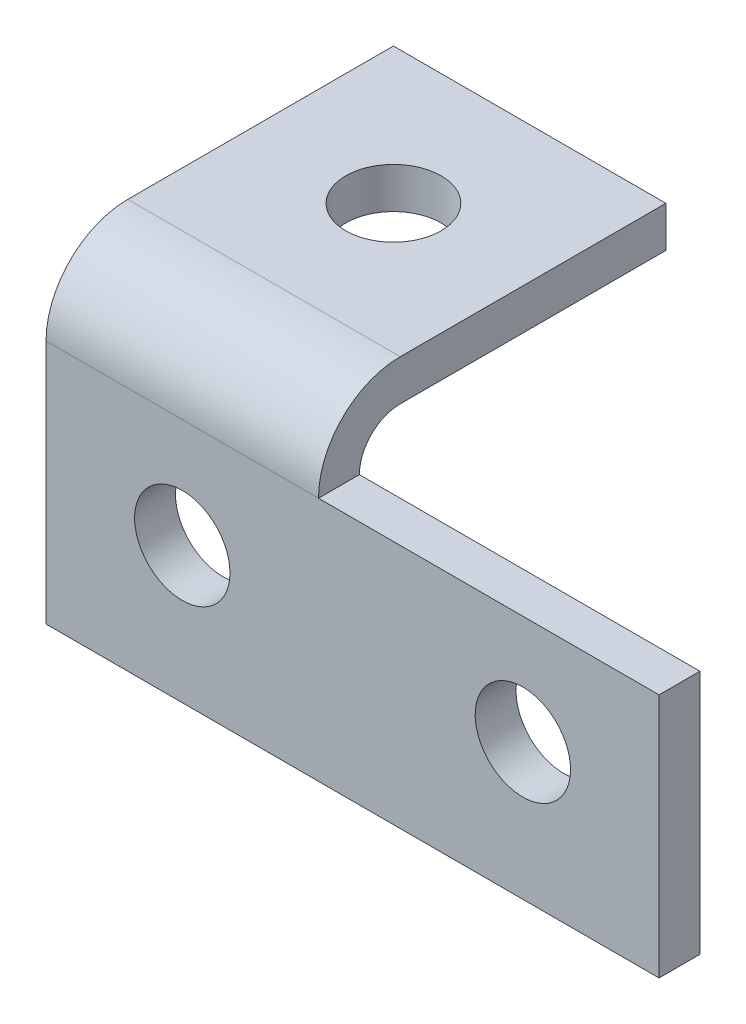
ISO-10303-21;
HEADER;
FILE_DESCRIPTION(('STEP AP214'),'2;1');
FILE_NAME('part.step','',(''),(''),'','','');
FILE_SCHEMA(('AUTOMOTIVE_DESIGN { 1 0 10303 214 1 1 1 1 }'));
ENDSEC;
DATA;
#1=APPLICATION_CONTEXT('core data for automotive mechanical design processes');
#2=APPLICATION_PROTOCOL_DEFINITION('international standard','automotive_design',2000,#1);
#3=PRODUCT_CONTEXT('',#1,'mechanical');
#4=PRODUCT('Part','Part','',(#3));
#5=PRODUCT_RELATED_PRODUCT_CATEGORY('part','',(#4));
#6=PRODUCT_DEFINITION_FORMATION('','',#4);
#7=PRODUCT_DEFINITION_CONTEXT('part definition',#1,'design');
#8=PRODUCT_DEFINITION('design','',#6,#7);
#9=PRODUCT_DEFINITION_SHAPE('','',#8);
#10=(LENGTH_UNIT() NAMED_UNIT(*) SI_UNIT(.MILLI.,.METRE.));
#11=(NAMED_UNIT(*) PLANE_ANGLE_UNIT() SI_UNIT($,.RADIAN.));
#12=(NAMED_UNIT(*) SI_UNIT($,.STERADIAN.) SOLID_ANGLE_UNIT());
#13=UNCERTAINTY_MEASURE_WITH_UNIT(LENGTH_MEASURE(1.E-05),#10,'distance_accuracy_value','');
#14=(GEOMETRIC_REPRESENTATION_CONTEXT(3) GLOBAL_UNCERTAINTY_ASSIGNED_CONTEXT((#13)) GLOBAL_UNIT_ASSIGNED_CONTEXT((#10,
#11,#12)) REPRESENTATION_CONTEXT('',''));
#15=CARTESIAN_POINT('',(0.,0.,0.));
#16=DIRECTION('',(0.,0.,1.));
#17=DIRECTION('',(1.,0.,0.));
#18=AXIS2_PLACEMENT_3D('',#15,#16,#17);
#19=CARTESIAN_POINT('',(-89.9999999999999,36.,0.));
#20=DIRECTION('',(0.,0.,1.));
#21=DIRECTION('',(0.,-1.,0.));
#22=AXIS2_PLACEMENT_3D('',#19,#20,#21);
#23=PLANE('',#22);
#24=CARTESIAN_POINT('',(-20.,20.,0.));
#25=DIRECTION('',(0.,0.,-1.));
#26=DIRECTION('',(0.,1.,0.));
#27=AXIS2_PLACEMENT_3D('',#24,#25,#26);
#28=CIRCLE('',#27,6.99999999999998);
#29=CARTESIAN_POINT('',(-20.,27.,0.));
#30=VERTEX_POINT('',#29);
#31=EDGE_CURVE('E191',#30,#30,#28,.T.);
#32=ORIENTED_EDGE('',*,*,#31,.T.);
#33=EDGE_LOOP('',(#32));
#34=FACE_BOUND('',#33,.T.);
#35=CARTESIAN_POINT('',(-69.9999999999999,20.0000000000001,0.));
#36=DIRECTION('',(0.,0.,1.));
#37=DIRECTION('',(1.,0.,0.));
#38=AXIS2_PLACEMENT_3D('',#35,#36,#37);
#39=CIRCLE('',#38,6.99999999999998);
#40=CARTESIAN_POINT('',(-62.9999999999999,20.0000000000001,0.));
#41=VERTEX_POINT('',#40);
#42=EDGE_CURVE('E187',#41,#41,#39,.T.);
#43=ORIENTED_EDGE('',*,*,#42,.F.);
#44=EDGE_LOOP('',(#43));
#45=FACE_BOUND('',#44,.T.);
#46=DIRECTION('',(1.,0.,0.));
#47=VECTOR('',#46,1.);
#48=CARTESIAN_POINT('',(-89.9999999999999,0.,0.));
#49=LINE('',#48,#47);
#50=CARTESIAN_POINT('',(-89.9999999999999,0.,0.));
#51=VERTEX_POINT('',#50);
#52=CARTESIAN_POINT('',(0.,0.,0.));
#53=VERTEX_POINT('',#52);
#54=EDGE_CURVE('E81',#51,#53,#49,.T.);
#55=ORIENTED_EDGE('',*,*,#54,.T.);
#56=DIRECTION('',(0.,-1.,0.));
#57=VECTOR('',#56,1.);
#58=CARTESIAN_POINT('',(0.,0.,0.));
#59=LINE('',#58,#57);
#60=CARTESIAN_POINT('',(0.,36.,0.));
#61=VERTEX_POINT('',#60);
#62=EDGE_CURVE('E126',#61,#53,#59,.T.);
#63=ORIENTED_EDGE('',*,*,#62,.F.);
#64=DIRECTION('',(-1.,0.,0.));
#65=VECTOR('',#64,1.);
#66=CARTESIAN_POINT('',(0.,36.,0.));
#67=LINE('',#66,#65);
#68=CARTESIAN_POINT('',(-49.9999999999999,36.,0.));
#69=VERTEX_POINT('',#68);
#70=EDGE_CURVE('E122',#61,#69,#67,.T.);
#71=ORIENTED_EDGE('',*,*,#70,.T.);
#72=DIRECTION('',(1.,0.,0.));
#73=VECTOR('',#72,1.);
#74=CARTESIAN_POINT('',(-89.9999999999999,36.,0.));
#75=LINE('',#74,#73);
#76=CARTESIAN_POINT('',(-89.9999999999999,36.,0.));
#77=VERTEX_POINT('',#76);
#78=EDGE_CURVE('E11',#77,#69,#75,.T.);
#79=ORIENTED_EDGE('',*,*,#78,.F.);
#80=DIRECTION('',(0.,-1.,0.));
#81=VECTOR('',#80,1.);
#82=CARTESIAN_POINT('',(-89.9999999999999,36.,0.));
#83=LINE('',#82,#81);
#84=EDGE_CURVE('E164',#77,#51,#83,.T.);
#85=ORIENTED_EDGE('',*,*,#84,.T.);
#86=EDGE_LOOP('',(#55,#63,#71,#79,#85));
#87=FACE_BOUND('',#86,.T.);
#88=ADVANCED_FACE('F35',(#34,#45,#87),#23,.T.);
#89=CARTESIAN_POINT('',(-89.9999999999999,36.,-12.));
#90=DIRECTION('',(1.,0.,0.));
#91=DIRECTION('',(0.,0.,-1.));
#92=AXIS2_PLACEMENT_3D('',#89,#90,#91);
#93=CYLINDRICAL_SURFACE('',#92,12.);
#94=CARTESIAN_POINT('',(-49.9999999999999,36.,-12.));
#95=DIRECTION('',(1.,0.,0.));
#96=DIRECTION('',(0.,0.,-1.));
#97=AXIS2_PLACEMENT_3D('',#94,#95,#96);
#98=CIRCLE('',#97,12.);
#99=CARTESIAN_POINT('',(-49.9999999999999,48.,-12.));
#100=VERTEX_POINT('',#99);
#101=EDGE_CURVE('E167',#100,#69,#98,.T.);
#102=ORIENTED_EDGE('',*,*,#101,.F.);
#103=DIRECTION('',(1.,0.,0.));
#104=VECTOR('',#103,1.);
#105=CARTESIAN_POINT('',(-89.9999999999999,48.,-12.));
#106=LINE('',#105,#104);
#107=CARTESIAN_POINT('',(-89.9999999999999,48.,-12.));
#108=VERTEX_POINT('',#107);
#109=EDGE_CURVE('E43',#108,#100,#106,.T.);
#110=ORIENTED_EDGE('',*,*,#109,.F.);
#111=CARTESIAN_POINT('',(-89.9999999999999,36.,-12.));
#112=DIRECTION('',(1.,0.,0.));
#113=DIRECTION('',(0.,0.,-1.));
#114=AXIS2_PLACEMENT_3D('',#111,#112,#113);
#115=CIRCLE('',#114,12.);
#116=EDGE_CURVE('E173',#108,#77,#115,.T.);
#117=ORIENTED_EDGE('',*,*,#116,.T.);
#118=ORIENTED_EDGE('',*,*,#78,.T.);
#119=EDGE_LOOP('',(#102,#110,#117,#118));
#120=FACE_BOUND('',#119,.T.);
#121=ADVANCED_FACE('F231',(#120),#93,.T.);
#122=CARTESIAN_POINT('',(-89.9999999999999,48.,-51.));
#123=DIRECTION('',(0.,1.,0.));
#124=DIRECTION('',(0.,0.,1.));
#125=AXIS2_PLACEMENT_3D('',#122,#123,#124);
#126=PLANE('',#125);
#127=CARTESIAN_POINT('',(-69.9999999999999,48.0000000000001,-30.9999999999999));
#128=DIRECTION('',(0.,-1.,0.));
#129=DIRECTION('',(0.,0.,-1.));
#130=AXIS2_PLACEMENT_3D('',#127,#128,#129);
#131=CIRCLE('',#130,6.99999999999998);
#132=CARTESIAN_POINT('',(-69.9999999999999,48.0000000000001,-37.9999999999999));
#133=VERTEX_POINT('',#132);
#134=EDGE_CURVE('E201',#133,#133,#131,.T.);
#135=ORIENTED_EDGE('',*,*,#134,.T.);
#136=EDGE_LOOP('',(#135));
#137=FACE_BOUND('',#136,.T.);
#138=DIRECTION('',(0.,0.,1.));
#139=VECTOR('',#138,1.);
#140=CARTESIAN_POINT('',(-49.9999999999999,48.,-51.));
#141=LINE('',#140,#139);
#142=CARTESIAN_POINT('',(-49.9999999999999,48.,-51.));
#143=VERTEX_POINT('',#142);
#144=EDGE_CURVE('E177',#143,#100,#141,.T.);
#145=ORIENTED_EDGE('',*,*,#144,.F.);
#146=DIRECTION('',(1.,0.,0.));
#147=VECTOR('',#146,1.);
#148=CARTESIAN_POINT('',(-89.9999999999999,48.,-51.));
#149=LINE('',#148,#147);
#150=CARTESIAN_POINT('',(-89.9999999999999,48.,-51.));
#151=VERTEX_POINT('',#150);
#152=EDGE_CURVE('E181',#151,#143,#149,.T.);
#153=ORIENTED_EDGE('',*,*,#152,.F.);
#154=DIRECTION('',(0.,0.,1.));
#155=VECTOR('',#154,1.);
#156=CARTESIAN_POINT('',(-89.9999999999999,48.,-51.));
#157=LINE('',#156,#155);
#158=EDGE_CURVE('E171',#151,#108,#157,.T.);
#159=ORIENTED_EDGE('',*,*,#158,.T.);
#160=ORIENTED_EDGE('',*,*,#109,.T.);
#161=EDGE_LOOP('',(#145,#153,#159,#160));
#162=FACE_BOUND('',#161,.T.);
#163=ADVANCED_FACE('F228',(#137,#162),#126,.T.);
#164=CARTESIAN_POINT('',(-89.9999999999999,0.,-50.9999999999999));
#165=DIRECTION('',(0.,0.,-1.));
#166=DIRECTION('',(0.,1.,0.));
#167=AXIS2_PLACEMENT_3D('',#164,#165,#166);
#168=PLANE('',#167);
#169=DIRECTION('',(-1.,0.,0.));
#170=VECTOR('',#169,1.);
#171=CARTESIAN_POINT('',(-49.9999999999999,42.0000000000001,-51.));
#172=LINE('',#171,#170);
#173=CARTESIAN_POINT('',(-49.9999999999999,42.0000000000001,-51.));
#174=VERTEX_POINT('',#173);
#175=CARTESIAN_POINT('',(-89.9999999999999,42.0000000000001,-51.));
#176=VERTEX_POINT('',#175);
#177=EDGE_CURVE('E156',#174,#176,#172,.T.);
#178=ORIENTED_EDGE('',*,*,#177,.T.);
#179=DIRECTION('',(0.,1.,0.));
#180=VECTOR('',#179,1.);
#181=CARTESIAN_POINT('',(-89.9999999999999,0.,-50.9999999999999));
#182=LINE('',#181,#180);
#183=EDGE_CURVE('E169',#176,#151,#182,.T.);
#184=ORIENTED_EDGE('',*,*,#183,.T.);
#185=ORIENTED_EDGE('',*,*,#152,.T.);
#186=DIRECTION('',(0.,1.,0.));
#187=VECTOR('',#186,1.);
#188=CARTESIAN_POINT('',(-49.9999999999999,0.,-50.9999999999999));
#189=LINE('',#188,#187);
#190=EDGE_CURVE('E159',#174,#143,#189,.T.);
#191=ORIENTED_EDGE('',*,*,#190,.F.);
#192=EDGE_LOOP('',(#178,#184,#185,#191));
#193=FACE_BOUND('',#192,.T.);
#194=ADVANCED_FACE('F223',(#193),#168,.T.);
#195=CARTESIAN_POINT('',(-89.9999999999999,0.,0.));
#196=DIRECTION('',(0.,-1.,0.));
#197=DIRECTION('',(0.,0.,-1.));
#198=AXIS2_PLACEMENT_3D('',#195,#196,#197);
#199=PLANE('',#198);
#200=DIRECTION('',(-1.,0.,0.));
#201=VECTOR('',#200,1.);
#202=CARTESIAN_POINT('',(-49.9999999999999,0.,-6.00000000000005));
#203=LINE('',#202,#201);
#204=CARTESIAN_POINT('',(0.,0.,-6.00000000000001));
#205=VERTEX_POINT('',#204);
#206=CARTESIAN_POINT('',(-89.9999999999999,0.,-6.00000000000005));
#207=VERTEX_POINT('',#206);
#208=EDGE_CURVE('E151',#205,#207,#203,.T.);
#209=ORIENTED_EDGE('',*,*,#208,.F.);
#210=DIRECTION('',(0.,0.,-1.));
#211=VECTOR('',#210,1.);
#212=CARTESIAN_POINT('',(0.,0.,-6.00000000000001));
#213=LINE('',#212,#211);
#214=EDGE_CURVE('E132',#53,#205,#213,.T.);
#215=ORIENTED_EDGE('',*,*,#214,.F.);
#216=ORIENTED_EDGE('',*,*,#54,.F.);
#217=DIRECTION('',(0.,0.,-1.));
#218=VECTOR('',#217,1.);
#219=CARTESIAN_POINT('',(-89.9999999999999,0.,0.));
#220=LINE('',#219,#218);
#221=EDGE_CURVE('E166',#51,#207,#220,.T.);
#222=ORIENTED_EDGE('',*,*,#221,.T.);
#223=EDGE_LOOP('',(#209,#215,#216,#222));
#224=FACE_BOUND('',#223,.T.);
#225=ADVANCED_FACE('F184',(#224),#199,.T.);
#226=CARTESIAN_POINT('',(-89.9999999999999,36.,-12.));
#227=DIRECTION('',(1.,0.,0.));
#228=DIRECTION('',(0.,0.,-1.));
#229=AXIS2_PLACEMENT_3D('',#226,#227,#228);
#230=PLANE('',#229);
#231=ORIENTED_EDGE('',*,*,#183,.F.);
#232=DIRECTION('',(0.,0.,-1.));
#233=VECTOR('',#232,1.);
#234=CARTESIAN_POINT('',(-89.9999999999999,42.,-12.0000000000001));
#235=LINE('',#234,#233);
#236=CARTESIAN_POINT('',(-89.9999999999999,42.,-12.0000000000001));
#237=VERTEX_POINT('',#236);
#238=EDGE_CURVE('E149',#237,#176,#235,.T.);
#239=ORIENTED_EDGE('',*,*,#238,.F.);
#240=CARTESIAN_POINT('',(-89.9999999999999,36.,-12.0000000000001));
#241=DIRECTION('',(-1.,0.,0.));
#242=DIRECTION('',(0.,0.,1.));
#243=AXIS2_PLACEMENT_3D('',#240,#241,#242);
#244=CIRCLE('',#243,6.);
#245=CARTESIAN_POINT('',(-89.9999999999999,36.,-6.00000000000005));
#246=VERTEX_POINT('',#245);
#247=EDGE_CURVE('E141',#246,#237,#244,.T.);
#248=ORIENTED_EDGE('',*,*,#247,.F.);
#249=DIRECTION('',(0.,1.,0.));
#250=VECTOR('',#249,1.);
#251=CARTESIAN_POINT('',(-89.9999999999999,0.,-6.00000000000005));
#252=LINE('',#251,#250);
#253=EDGE_CURVE('E139',#207,#246,#252,.T.);
#254=ORIENTED_EDGE('',*,*,#253,.F.);
#255=ORIENTED_EDGE('',*,*,#221,.F.);
#256=ORIENTED_EDGE('',*,*,#84,.F.);
#257=ORIENTED_EDGE('',*,*,#116,.F.);
#258=ORIENTED_EDGE('',*,*,#158,.F.);
#259=EDGE_LOOP('',(#231,#239,#248,#254,#255,#256,#257,#258));
#260=FACE_BOUND('',#259,.T.);
#261=ADVANCED_FACE('F226',(#260),#230,.F.);
#262=CARTESIAN_POINT('',(-49.9999999999999,36.,-12.));
#263=DIRECTION('',(1.,0.,0.));
#264=DIRECTION('',(0.,0.,-1.));
#265=AXIS2_PLACEMENT_3D('',#262,#263,#264);
#266=PLANE('',#265);
#267=DIRECTION('',(0.,0.,1.));
#268=VECTOR('',#267,1.);
#269=CARTESIAN_POINT('',(-49.9999999999999,36.,0.));
#270=LINE('',#269,#268);
#271=CARTESIAN_POINT('',(-49.9999999999999,36.,-6.00000000000005));
#272=VERTEX_POINT('',#271);
#273=EDGE_CURVE('E51',#272,#69,#270,.T.);
#274=ORIENTED_EDGE('',*,*,#273,.F.);
#275=CARTESIAN_POINT('',(-49.9999999999999,36.,-12.0000000000001));
#276=DIRECTION('',(-1.,0.,0.));
#277=DIRECTION('',(0.,0.,1.));
#278=AXIS2_PLACEMENT_3D('',#275,#276,#277);
#279=CIRCLE('',#278,6.);
#280=CARTESIAN_POINT('',(-49.9999999999999,42.,-12.0000000000001));
#281=VERTEX_POINT('',#280);
#282=EDGE_CURVE('E146',#272,#281,#279,.T.);
#283=ORIENTED_EDGE('',*,*,#282,.T.);
#284=DIRECTION('',(0.,0.,-1.));
#285=VECTOR('',#284,1.);
#286=CARTESIAN_POINT('',(-49.9999999999999,42.,-12.0000000000001));
#287=LINE('',#286,#285);
#288=EDGE_CURVE('E148',#281,#174,#287,.T.);
#289=ORIENTED_EDGE('',*,*,#288,.T.);
#290=ORIENTED_EDGE('',*,*,#190,.T.);
#291=ORIENTED_EDGE('',*,*,#144,.T.);
#292=ORIENTED_EDGE('',*,*,#101,.T.);
#293=EDGE_LOOP('',(#274,#283,#289,#290,#291,#292));
#294=FACE_BOUND('',#293,.T.);
#295=ADVANCED_FACE('F214',(#294),#266,.T.);
#296=CARTESIAN_POINT('',(-49.9999999999999,42.,-12.0000000000001));
#297=DIRECTION('',(0.,1.,0.));
#298=DIRECTION('',(0.,0.,1.));
#299=AXIS2_PLACEMENT_3D('',#296,#297,#298);
#300=PLANE('',#299);
#301=CARTESIAN_POINT('',(-69.9999999999999,42.0000000000001,-30.9999999999999));
#302=DIRECTION('',(0.,-1.,0.));
#303=DIRECTION('',(0.,0.,-1.));
#304=AXIS2_PLACEMENT_3D('',#301,#302,#303);
#305=CIRCLE('',#304,6.99999999999998);
#306=CARTESIAN_POINT('',(-69.9999999999999,42.0000000000001,-37.9999999999999));
#307=VERTEX_POINT('',#306);
#308=EDGE_CURVE('E204',#307,#307,#305,.T.);
#309=ORIENTED_EDGE('',*,*,#308,.F.);
#310=EDGE_LOOP('',(#309));
#311=FACE_BOUND('',#310,.T.);
#312=ORIENTED_EDGE('',*,*,#238,.T.);
#313=ORIENTED_EDGE('',*,*,#177,.F.);
#314=ORIENTED_EDGE('',*,*,#288,.F.);
#315=DIRECTION('',(-1.,0.,0.));
#316=VECTOR('',#315,1.);
#317=CARTESIAN_POINT('',(-49.9999999999999,42.,-12.0000000000001));
#318=LINE('',#317,#316);
#319=EDGE_CURVE('E160',#281,#237,#318,.T.);
#320=ORIENTED_EDGE('',*,*,#319,.T.);
#321=EDGE_LOOP('',(#312,#313,#314,#320));
#322=FACE_BOUND('',#321,.T.);
#323=ADVANCED_FACE('F210',(#311,#322),#300,.F.);
#324=CARTESIAN_POINT('',(-49.9999999999999,36.,-12.0000000000001));
#325=DIRECTION('',(-1.,0.,0.));
#326=DIRECTION('',(0.,0.,1.));
#327=AXIS2_PLACEMENT_3D('',#324,#325,#326);
#328=CYLINDRICAL_SURFACE('',#327,6.);
#329=ORIENTED_EDGE('',*,*,#247,.T.);
#330=ORIENTED_EDGE('',*,*,#319,.F.);
#331=ORIENTED_EDGE('',*,*,#282,.F.);
#332=DIRECTION('',(-1.,0.,0.));
#333=VECTOR('',#332,1.);
#334=CARTESIAN_POINT('',(-49.9999999999999,36.,-6.00000000000005));
#335=LINE('',#334,#333);
#336=EDGE_CURVE('E138',#272,#246,#335,.T.);
#337=ORIENTED_EDGE('',*,*,#336,.T.);
#338=EDGE_LOOP('',(#329,#330,#331,#337));
#339=FACE_BOUND('',#338,.T.);
#340=ADVANCED_FACE('F213',(#339),#328,.F.);
#341=CARTESIAN_POINT('',(-49.9999999999999,0.,-6.00000000000005));
#342=DIRECTION('',(0.,0.,1.));
#343=DIRECTION('',(0.,-1.,0.));
#344=AXIS2_PLACEMENT_3D('',#341,#342,#343);
#345=PLANE('',#344);
#346=CARTESIAN_POINT('',(-20.,20.,-6.00000000000005));
#347=DIRECTION('',(0.,0.,-1.));
#348=DIRECTION('',(0.,1.,0.));
#349=AXIS2_PLACEMENT_3D('',#346,#347,#348);
#350=CIRCLE('',#349,6.99999999999998);
#351=CARTESIAN_POINT('',(-20.,27.,-6.00000000000005));
#352=VERTEX_POINT('',#351);
#353=EDGE_CURVE('E196',#352,#352,#350,.T.);
#354=ORIENTED_EDGE('',*,*,#353,.F.);
#355=EDGE_LOOP('',(#354));
#356=FACE_BOUND('',#355,.T.);
#357=CARTESIAN_POINT('',(-69.9999999999999,20.0000000000001,-6.00000000000005));
#358=DIRECTION('',(0.,0.,1.));
#359=DIRECTION('',(0.,-1.,0.));
#360=AXIS2_PLACEMENT_3D('',#357,#358,#359);
#361=CIRCLE('',#360,6.99999999999998);
#362=CARTESIAN_POINT('',(-69.9999999999999,13.0000000000001,-6.00000000000005));
#363=VERTEX_POINT('',#362);
#364=EDGE_CURVE('E38',#363,#363,#361,.T.);
#365=ORIENTED_EDGE('',*,*,#364,.T.);
#366=EDGE_LOOP('',(#365));
#367=FACE_BOUND('',#366,.T.);
#368=ORIENTED_EDGE('',*,*,#253,.T.);
#369=ORIENTED_EDGE('',*,*,#336,.F.);
#370=DIRECTION('',(-1.,0.,0.));
#371=VECTOR('',#370,1.);
#372=CARTESIAN_POINT('',(0.,36.,-6.00000000000004));
#373=LINE('',#372,#371);
#374=CARTESIAN_POINT('',(0.,36.,-6.00000000000004));
#375=VERTEX_POINT('',#374);
#376=EDGE_CURVE('E121',#375,#272,#373,.T.);
#377=ORIENTED_EDGE('',*,*,#376,.F.);
#378=DIRECTION('',(0.,1.,0.));
#379=VECTOR('',#378,1.);
#380=CARTESIAN_POINT('',(0.,36.,-6.00000000000004));
#381=LINE('',#380,#379);
#382=EDGE_CURVE('E127',#205,#375,#381,.T.);
#383=ORIENTED_EDGE('',*,*,#382,.F.);
#384=ORIENTED_EDGE('',*,*,#208,.T.);
#385=EDGE_LOOP('',(#368,#369,#377,#383,#384));
#386=FACE_BOUND('',#385,.T.);
#387=ADVANCED_FACE('F137',(#356,#367,#386),#345,.F.);
#388=CARTESIAN_POINT('',(0.,36.,0.));
#389=DIRECTION('',(0.,-1.,0.));
#390=DIRECTION('',(0.,0.,-1.));
#391=AXIS2_PLACEMENT_3D('',#388,#389,#390);
#392=PLANE('',#391);
#393=ORIENTED_EDGE('',*,*,#273,.T.);
#394=ORIENTED_EDGE('',*,*,#70,.F.);
#395=DIRECTION('',(0.,0.,1.));
#396=VECTOR('',#395,1.);
#397=CARTESIAN_POINT('',(0.,36.,0.));
#398=LINE('',#397,#396);
#399=EDGE_CURVE('E117',#375,#61,#398,.T.);
#400=ORIENTED_EDGE('',*,*,#399,.F.);
#401=ORIENTED_EDGE('',*,*,#376,.T.);
#402=EDGE_LOOP('',(#393,#394,#400,#401));
#403=FACE_BOUND('',#402,.T.);
#404=ADVANCED_FACE('F119',(#403),#392,.F.);
#405=CARTESIAN_POINT('',(0.,0.,0.));
#406=DIRECTION('',(-1.,0.,0.));
#407=DIRECTION('',(0.,0.,1.));
#408=AXIS2_PLACEMENT_3D('',#405,#406,#407);
#409=PLANE('',#408);
#410=ORIENTED_EDGE('',*,*,#382,.T.);
#411=ORIENTED_EDGE('',*,*,#399,.T.);
#412=ORIENTED_EDGE('',*,*,#62,.T.);
#413=ORIENTED_EDGE('',*,*,#214,.T.);
#414=EDGE_LOOP('',(#410,#411,#412,#413));
#415=FACE_BOUND('',#414,.T.);
#416=ADVANCED_FACE('F131',(#415),#409,.F.);
#417=CARTESIAN_POINT('',(-69.9999999999999,20.0000000000001,0.));
#418=DIRECTION('',(0.,0.,1.));
#419=DIRECTION('',(1.,0.,0.));
#420=AXIS2_PLACEMENT_3D('',#417,#418,#419);
#421=CYLINDRICAL_SURFACE('',#420,6.99999999999998);
#422=ORIENTED_EDGE('',*,*,#42,.T.);
#423=EDGE_LOOP('',(#422));
#424=FACE_BOUND('',#423,.T.);
#425=ORIENTED_EDGE('',*,*,#364,.F.);
#426=EDGE_LOOP('',(#425));
#427=FACE_BOUND('',#426,.T.);
#428=ADVANCED_FACE('F263',(#424,#427),#421,.F.);
#429=CARTESIAN_POINT('',(-20.,20.,-6.00000000000005));
#430=DIRECTION('',(0.,0.,-1.));
#431=DIRECTION('',(0.,1.,0.));
#432=AXIS2_PLACEMENT_3D('',#429,#430,#431);
#433=CYLINDRICAL_SURFACE('',#432,6.99999999999998);
#434=ORIENTED_EDGE('',*,*,#31,.F.);
#435=EDGE_LOOP('',(#434));
#436=FACE_BOUND('',#435,.T.);
#437=ORIENTED_EDGE('',*,*,#353,.T.);
#438=EDGE_LOOP('',(#437));
#439=FACE_BOUND('',#438,.T.);
#440=ADVANCED_FACE('F266',(#436,#439),#433,.F.);
#441=CARTESIAN_POINT('',(-69.9999999999999,42.0000000000001,-30.9999999999999));
#442=DIRECTION('',(0.,-1.,0.));
#443=DIRECTION('',(0.,0.,-1.));
#444=AXIS2_PLACEMENT_3D('',#441,#442,#443);
#445=CYLINDRICAL_SURFACE('',#444,6.99999999999998);
#446=ORIENTED_EDGE('',*,*,#134,.F.);
#447=EDGE_LOOP('',(#446));
#448=FACE_BOUND('',#447,.T.);
#449=ORIENTED_EDGE('',*,*,#308,.T.);
#450=EDGE_LOOP('',(#449));
#451=FACE_BOUND('',#450,.T.);
#452=ADVANCED_FACE('F208',(#448,#451),#445,.F.);
#453=CLOSED_SHELL('',(#88,#121,#163,#194,#225,#261,#295,#323,#340,#387,#404,#416,#428,#440,#452));
#454=MANIFOLD_SOLID_BREP('B2',#453);
#455=ADVANCED_BREP_SHAPE_REPRESENTATION('',(#18,#454),#14);
#456=SHAPE_DEFINITION_REPRESENTATION(#9,#455);
ENDSEC;
END-ISO-10303-21;
